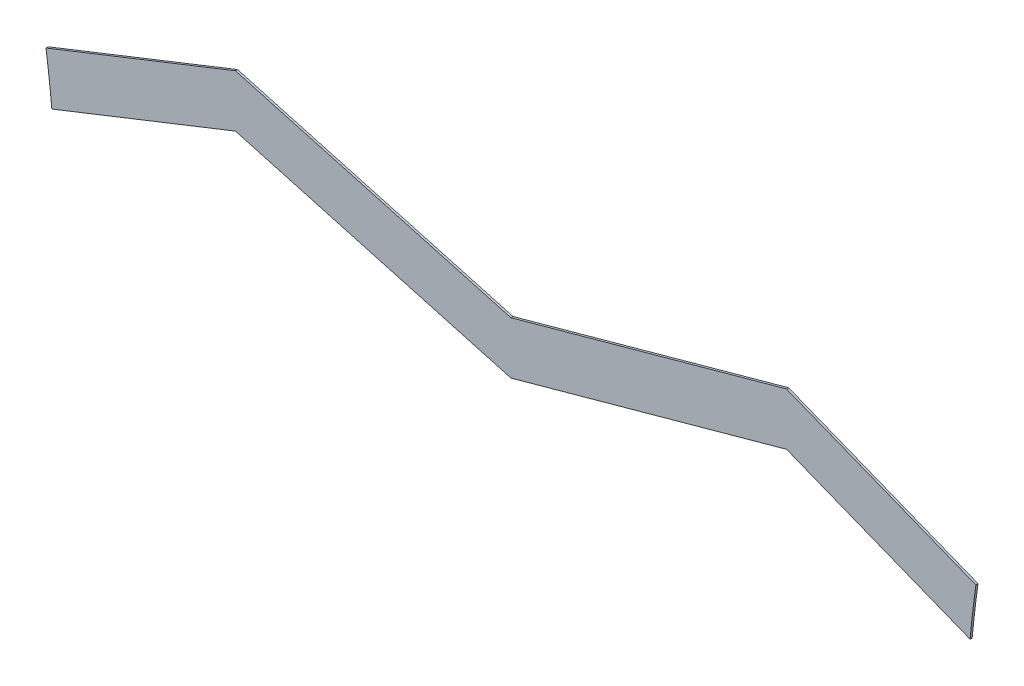
ISO-10303-21;
HEADER;
FILE_DESCRIPTION(('STEP AP214'),'2;1');
FILE_NAME('part.step','',(''),(''),'','','');
FILE_SCHEMA(('AUTOMOTIVE_DESIGN { 1 0 10303 214 1 1 1 1 }'));
ENDSEC;
DATA;
#1=APPLICATION_CONTEXT('core data for automotive mechanical design processes');
#2=APPLICATION_PROTOCOL_DEFINITION('international standard','automotive_design',2000,#1);
#3=PRODUCT_CONTEXT('',#1,'mechanical');
#4=PRODUCT('Part','Part','',(#3));
#5=PRODUCT_RELATED_PRODUCT_CATEGORY('part','',(#4));
#6=PRODUCT_DEFINITION_FORMATION('','',#4);
#7=PRODUCT_DEFINITION_CONTEXT('part definition',#1,'design');
#8=PRODUCT_DEFINITION('design','',#6,#7);
#9=PRODUCT_DEFINITION_SHAPE('','',#8);
#10=(LENGTH_UNIT() NAMED_UNIT(*) SI_UNIT(.MILLI.,.METRE.));
#11=(NAMED_UNIT(*) PLANE_ANGLE_UNIT() SI_UNIT($,.RADIAN.));
#12=(NAMED_UNIT(*) SI_UNIT($,.STERADIAN.) SOLID_ANGLE_UNIT());
#13=UNCERTAINTY_MEASURE_WITH_UNIT(LENGTH_MEASURE(1.E-05),#10,'distance_accuracy_value','');
#14=(GEOMETRIC_REPRESENTATION_CONTEXT(3) GLOBAL_UNCERTAINTY_ASSIGNED_CONTEXT((#13)) GLOBAL_UNIT_ASSIGNED_CONTEXT((#10,
#11,#12)) REPRESENTATION_CONTEXT('',''));
#15=CARTESIAN_POINT('',(0.,0.,0.));
#16=DIRECTION('',(0.,0.,1.));
#17=DIRECTION('',(1.,0.,0.));
#18=AXIS2_PLACEMENT_3D('',#15,#16,#17);
#19=CARTESIAN_POINT('',(113.057369661705,9.45282984114208,0.1));
#20=DIRECTION('',(0.,0.,-1.));
#21=DIRECTION('',(-1.,0.,0.));
#22=AXIS2_PLACEMENT_3D('',#19,#20,#21);
#23=CYLINDRICAL_SURFACE('',#22,53.0159410185819);
#24=CARTESIAN_POINT('',(113.057369661705,9.45282984114208,0.));
#25=DIRECTION('',(0.,0.,-1.));
#26=DIRECTION('',(1.,0.,0.));
#27=AXIS2_PLACEMENT_3D('',#24,#25,#26);
#28=CIRCLE('',#27,53.0159410185819);
#29=CARTESIAN_POINT('',(60.2726956061977,14.3993626611678,0.));
#30=VERTEX_POINT('',#29);
#31=CARTESIAN_POINT('',(60.5514605315682,16.7890078994745,0.));
#32=VERTEX_POINT('',#31);
#33=EDGE_CURVE('E142',#30,#32,#28,.T.);
#34=ORIENTED_EDGE('',*,*,#33,.T.);
#35=DIRECTION('',(0.,0.,-1.));
#36=VECTOR('',#35,1.);
#37=CARTESIAN_POINT('',(60.5514605315682,16.7890078994745,0.1));
#38=LINE('',#37,#36);
#39=CARTESIAN_POINT('',(60.5514605315682,16.7890078994745,0.1));
#40=VERTEX_POINT('',#39);
#41=EDGE_CURVE('E11',#40,#32,#38,.T.);
#42=ORIENTED_EDGE('',*,*,#41,.F.);
#43=CARTESIAN_POINT('',(113.057369661705,9.45282984114208,0.1));
#44=DIRECTION('',(0.,0.,-1.));
#45=DIRECTION('',(1.,0.,0.));
#46=AXIS2_PLACEMENT_3D('',#43,#44,#45);
#47=CIRCLE('',#46,53.0159410185819);
#48=CARTESIAN_POINT('',(60.2726956061977,14.3993626611678,0.1));
#49=VERTEX_POINT('',#48);
#50=EDGE_CURVE('E162',#49,#40,#47,.T.);
#51=ORIENTED_EDGE('',*,*,#50,.F.);
#52=DIRECTION('',(0.,0.,-1.));
#53=VECTOR('',#52,1.);
#54=CARTESIAN_POINT('',(60.2726956061977,14.3993626611678,0.1));
#55=LINE('',#54,#53);
#56=EDGE_CURVE('E138',#49,#30,#55,.T.);
#57=ORIENTED_EDGE('',*,*,#56,.T.);
#58=EDGE_LOOP('',(#34,#42,#51,#57));
#59=FACE_BOUND('',#58,.T.);
#60=ADVANCED_FACE('F33',(#59),#23,.F.);
#61=CARTESIAN_POINT('',(51.4919802703171,20.3753872976957,0.1));
#62=DIRECTION('',(-0.368078186645423,-0.929794842164559,0.));
#63=DIRECTION('',(0.929794842164559,-0.368078186645423,0.));
#64=AXIS2_PLACEMENT_3D('',#61,#62,#63);
#65=PLANE('',#64);
#66=DIRECTION('',(-0.929794842164559,0.368078186645423,0.));
#67=VECTOR('',#66,1.);
#68=CARTESIAN_POINT('',(51.4919802703171,20.3753872976957,0.));
#69=LINE('',#68,#67);
#70=CARTESIAN_POINT('',(51.4919802703171,20.3753872976957,0.));
#71=VERTEX_POINT('',#70);
#72=EDGE_CURVE('E145',#32,#71,#69,.T.);
#73=ORIENTED_EDGE('',*,*,#72,.T.);
#74=DIRECTION('',(0.,0.,-1.));
#75=VECTOR('',#74,1.);
#76=CARTESIAN_POINT('',(51.4919802703171,20.3753872976957,0.1));
#77=LINE('',#76,#75);
#78=CARTESIAN_POINT('',(51.4919802703171,20.3753872976957,0.1));
#79=VERTEX_POINT('',#78);
#80=EDGE_CURVE('E41',#79,#71,#77,.T.);
#81=ORIENTED_EDGE('',*,*,#80,.F.);
#82=DIRECTION('',(-0.929794842164559,0.368078186645423,0.));
#83=VECTOR('',#82,1.);
#84=CARTESIAN_POINT('',(51.4919802703171,20.3753872976957,0.1));
#85=LINE('',#84,#83);
#86=EDGE_CURVE('E96',#40,#79,#85,.T.);
#87=ORIENTED_EDGE('',*,*,#86,.F.);
#88=ORIENTED_EDGE('',*,*,#41,.T.);
#89=EDGE_LOOP('',(#73,#81,#87,#88));
#90=FACE_BOUND('',#89,.T.);
#91=ADVANCED_FACE('F209',(#90),#65,.F.);
#92=CARTESIAN_POINT('',(38.3161420647393,16.7361587573909,0.1));
#93=DIRECTION('',(0.266235900568908,-0.963907902887129,0.));
#94=DIRECTION('',(0.963907902887129,0.266235900568908,0.));
#95=AXIS2_PLACEMENT_3D('',#92,#93,#94);
#96=PLANE('',#95);
#97=DIRECTION('',(-0.963907902887129,-0.266235900568908,0.));
#98=VECTOR('',#97,1.);
#99=CARTESIAN_POINT('',(38.3161420647393,16.7361587573909,0.));
#100=LINE('',#99,#98);
#101=CARTESIAN_POINT('',(38.3161420647393,16.7361587573909,0.));
#102=VERTEX_POINT('',#101);
#103=EDGE_CURVE('E147',#71,#102,#100,.T.);
#104=ORIENTED_EDGE('',*,*,#103,.T.);
#105=DIRECTION('',(0.,0.,-1.));
#106=VECTOR('',#105,1.);
#107=CARTESIAN_POINT('',(38.3161420647393,16.7361587573909,0.1));
#108=LINE('',#107,#106);
#109=CARTESIAN_POINT('',(38.3161420647393,16.7361587573909,0.1));
#110=VERTEX_POINT('',#109);
#111=EDGE_CURVE('E175',#110,#102,#108,.T.);
#112=ORIENTED_EDGE('',*,*,#111,.F.);
#113=DIRECTION('',(-0.963907902887129,-0.266235900568908,0.));
#114=VECTOR('',#113,1.);
#115=CARTESIAN_POINT('',(38.3161420647393,16.7361587573909,0.1));
#116=LINE('',#115,#114);
#117=EDGE_CURVE('E183',#79,#110,#116,.T.);
#118=ORIENTED_EDGE('',*,*,#117,.F.);
#119=ORIENTED_EDGE('',*,*,#80,.T.);
#120=EDGE_LOOP('',(#104,#112,#118,#119));
#121=FACE_BOUND('',#120,.T.);
#122=ADVANCED_FACE('F181',(#121),#96,.F.);
#123=CARTESIAN_POINT('',(25.1404262133166,20.375830252279,0.1));
#124=DIRECTION('',(-0.266268305901821,-0.96389895179535,0.));
#125=DIRECTION('',(0.96389895179535,-0.266268305901821,0.));
#126=AXIS2_PLACEMENT_3D('',#123,#124,#125);
#127=PLANE('',#126);
#128=DIRECTION('',(-0.96389895179535,0.266268305901821,0.));
#129=VECTOR('',#128,1.);
#130=CARTESIAN_POINT('',(25.1404262133166,20.375830252279,0.));
#131=LINE('',#130,#129);
#132=CARTESIAN_POINT('',(25.1404262133166,20.375830252279,0.));
#133=VERTEX_POINT('',#132);
#134=EDGE_CURVE('E149',#102,#133,#131,.T.);
#135=ORIENTED_EDGE('',*,*,#134,.T.);
#136=DIRECTION('',(0.,0.,-1.));
#137=VECTOR('',#136,1.);
#138=CARTESIAN_POINT('',(25.1404262133166,20.375830252279,0.1));
#139=LINE('',#138,#137);
#140=CARTESIAN_POINT('',(25.1404262133166,20.375830252279,0.1));
#141=VERTEX_POINT('',#140);
#142=EDGE_CURVE('E172',#141,#133,#139,.T.);
#143=ORIENTED_EDGE('',*,*,#142,.F.);
#144=DIRECTION('',(-0.96389895179535,0.266268305901821,0.));
#145=VECTOR('',#144,1.);
#146=CARTESIAN_POINT('',(25.1404262133166,20.375830252279,0.1));
#147=LINE('',#146,#145);
#148=EDGE_CURVE('E199',#110,#141,#147,.T.);
#149=ORIENTED_EDGE('',*,*,#148,.F.);
#150=ORIENTED_EDGE('',*,*,#111,.T.);
#151=EDGE_LOOP('',(#135,#143,#149,#150));
#152=FACE_BOUND('',#151,.T.);
#153=ADVANCED_FACE('F190',(#152),#127,.F.);
#154=CARTESIAN_POINT('',(16.0808253872037,16.7897554254692,0.1));
#155=DIRECTION('',(0.36804692779621,-0.929807216007583,0.));
#156=DIRECTION('',(0.929807216007583,0.36804692779621,0.));
#157=AXIS2_PLACEMENT_3D('',#154,#155,#156);
#158=PLANE('',#157);
#159=DIRECTION('',(-0.929807216007583,-0.36804692779621,0.));
#160=VECTOR('',#159,1.);
#161=CARTESIAN_POINT('',(16.0808253872037,16.7897554254692,0.));
#162=LINE('',#161,#160);
#163=CARTESIAN_POINT('',(16.0808253872037,16.7897554254692,0.));
#164=VERTEX_POINT('',#163);
#165=EDGE_CURVE('E151',#133,#164,#162,.T.);
#166=ORIENTED_EDGE('',*,*,#165,.T.);
#167=DIRECTION('',(0.,0.,-1.));
#168=VECTOR('',#167,1.);
#169=CARTESIAN_POINT('',(16.0808253872037,16.7897554254692,0.1));
#170=LINE('',#169,#168);
#171=CARTESIAN_POINT('',(16.0808253872037,16.7897554254692,0.1));
#172=VERTEX_POINT('',#171);
#173=EDGE_CURVE('E169',#172,#164,#170,.T.);
#174=ORIENTED_EDGE('',*,*,#173,.F.);
#175=DIRECTION('',(-0.929807216007583,-0.36804692779621,0.));
#176=VECTOR('',#175,1.);
#177=CARTESIAN_POINT('',(16.0808253872037,16.7897554254692,0.1));
#178=LINE('',#177,#176);
#179=EDGE_CURVE('E196',#141,#172,#178,.T.);
#180=ORIENTED_EDGE('',*,*,#179,.F.);
#181=ORIENTED_EDGE('',*,*,#142,.T.);
#182=EDGE_LOOP('',(#166,#174,#180,#181));
#183=FACE_BOUND('',#182,.T.);
#184=ADVANCED_FACE('F194',(#183),#158,.F.);
#185=CARTESIAN_POINT('',(-36.4253303471932,9.45534256001148,0.1));
#186=DIRECTION('',(0.,0.,-1.));
#187=DIRECTION('',(-1.,0.,0.));
#188=AXIS2_PLACEMENT_3D('',#185,#186,#187);
#189=CYLINDRICAL_SURFACE('',#188,53.0159410185817);
#190=CARTESIAN_POINT('',(-36.4253303471932,9.45534256001148,0.));
#191=DIRECTION('',(0.,0.,-1.));
#192=DIRECTION('',(1.,0.,0.));
#193=AXIS2_PLACEMENT_3D('',#190,#191,#192);
#194=CIRCLE('',#193,53.0159410185817);
#195=CARTESIAN_POINT('',(16.3595099752714,14.4001008167565,0.));
#196=VERTEX_POINT('',#195);
#197=EDGE_CURVE('E153',#164,#196,#194,.T.);
#198=ORIENTED_EDGE('',*,*,#197,.T.);
#199=DIRECTION('',(0.,0.,-1.));
#200=VECTOR('',#199,1.);
#201=CARTESIAN_POINT('',(16.3595099752714,14.4001008167565,0.1));
#202=LINE('',#201,#200);
#203=CARTESIAN_POINT('',(16.3595099752714,14.4001008167565,0.1));
#204=VERTEX_POINT('',#203);
#205=EDGE_CURVE('E166',#204,#196,#202,.T.);
#206=ORIENTED_EDGE('',*,*,#205,.F.);
#207=CARTESIAN_POINT('',(-36.4253303471932,9.45534256001148,0.1));
#208=DIRECTION('',(0.,0.,-1.));
#209=DIRECTION('',(1.,0.,0.));
#210=AXIS2_PLACEMENT_3D('',#207,#208,#209);
#211=CIRCLE('',#210,53.0159410185817);
#212=EDGE_CURVE('E198',#172,#204,#211,.T.);
#213=ORIENTED_EDGE('',*,*,#212,.F.);
#214=ORIENTED_EDGE('',*,*,#173,.T.);
#215=EDGE_LOOP('',(#198,#206,#213,#214));
#216=FACE_BOUND('',#215,.T.);
#217=ADVANCED_FACE('F221',(#216),#189,.F.);
#218=CARTESIAN_POINT('',(16.8070032090925,14.5772327071957,0.1));
#219=DIRECTION('',(-0.36804692779621,0.929807216007583,0.));
#220=DIRECTION('',(-0.929807216007583,-0.36804692779621,0.));
#221=AXIS2_PLACEMENT_3D('',#218,#219,#220);
#222=PLANE('',#221);
#223=DIRECTION('',(0.929807216007583,0.36804692779621,0.));
#224=VECTOR('',#223,1.);
#225=CARTESIAN_POINT('',(16.8070032090925,14.5772327071957,0.));
#226=LINE('',#225,#224);
#227=CARTESIAN_POINT('',(25.1403421661704,17.8758302536918,0.));
#228=VERTEX_POINT('',#227);
#229=EDGE_CURVE('E156',#196,#228,#226,.T.);
#230=ORIENTED_EDGE('',*,*,#229,.T.);
#231=DIRECTION('',(0.,0.,-1.));
#232=VECTOR('',#231,1.);
#233=CARTESIAN_POINT('',(25.1403421661704,17.8758302536918,0.1));
#234=LINE('',#233,#232);
#235=CARTESIAN_POINT('',(25.1403421661704,17.8758302536918,0.1));
#236=VERTEX_POINT('',#235);
#237=EDGE_CURVE('E133',#236,#228,#234,.T.);
#238=ORIENTED_EDGE('',*,*,#237,.F.);
#239=DIRECTION('',(0.929807216009125,0.368046927792312,0.));
#240=VECTOR('',#239,1.);
#241=CARTESIAN_POINT('',(16.3595099752714,14.4001008167565,0.1));
#242=LINE('',#241,#240);
#243=EDGE_CURVE('E122',#204,#236,#242,.T.);
#244=ORIENTED_EDGE('',*,*,#243,.F.);
#245=ORIENTED_EDGE('',*,*,#205,.T.);
#246=EDGE_LOOP('',(#230,#238,#244,#245));
#247=FACE_BOUND('',#246,.T.);
#248=ADVANCED_FACE('F224',(#247),#222,.F.);
#249=CARTESIAN_POINT('',(25.1403421661704,17.8758302536918,0.1));
#250=DIRECTION('',(0.266268305901821,0.96389895179535,0.));
#251=DIRECTION('',(-0.96389895179535,0.266268305901821,0.));
#252=AXIS2_PLACEMENT_3D('',#249,#250,#251);
#253=PLANE('',#252);
#254=DIRECTION('',(0.96389895179535,-0.266268305901821,0.));
#255=VECTOR('',#254,1.);
#256=CARTESIAN_POINT('',(25.1403421661704,17.8758302536918,0.));
#257=LINE('',#256,#255);
#258=CARTESIAN_POINT('',(38.3160580175931,14.2361587588036,0.));
#259=VERTEX_POINT('',#258);
#260=EDGE_CURVE('E131',#228,#259,#257,.T.);
#261=ORIENTED_EDGE('',*,*,#260,.T.);
#262=DIRECTION('',(0.,0.,-1.));
#263=VECTOR('',#262,1.);
#264=CARTESIAN_POINT('',(38.3160580175931,14.2361587588036,0.1));
#265=LINE('',#264,#263);
#266=CARTESIAN_POINT('',(38.3160580175931,14.2361587588036,0.1));
#267=VERTEX_POINT('',#266);
#268=EDGE_CURVE('E128',#267,#259,#265,.T.);
#269=ORIENTED_EDGE('',*,*,#268,.F.);
#270=DIRECTION('',(0.96389895179535,-0.266268305901821,0.));
#271=VECTOR('',#270,1.);
#272=CARTESIAN_POINT('',(25.1403421661704,17.8758302536918,0.1));
#273=LINE('',#272,#271);
#274=EDGE_CURVE('E115',#236,#267,#273,.T.);
#275=ORIENTED_EDGE('',*,*,#274,.F.);
#276=ORIENTED_EDGE('',*,*,#237,.T.);
#277=EDGE_LOOP('',(#261,#269,#275,#276));
#278=FACE_BOUND('',#277,.T.);
#279=ADVANCED_FACE('F129',(#278),#253,.F.);
#280=CARTESIAN_POINT('',(51.4919802703171,17.8753872976957,0.1));
#281=DIRECTION('',(-0.266234322571186,0.963908338736138,0.));
#282=DIRECTION('',(-0.963908338736138,-0.266234322571186,0.));
#283=AXIS2_PLACEMENT_3D('',#280,#281,#282);
#284=PLANE('',#283);
#285=DIRECTION('',(0.963908338736138,0.266234322571186,0.));
#286=VECTOR('',#285,1.);
#287=CARTESIAN_POINT('',(51.4919802703171,17.8753872976957,0.));
#288=LINE('',#287,#286);
#289=CARTESIAN_POINT('',(51.4919802703171,17.8753872976957,0.));
#290=VERTEX_POINT('',#289);
#291=EDGE_CURVE('E159',#259,#290,#288,.T.);
#292=ORIENTED_EDGE('',*,*,#291,.T.);
#293=DIRECTION('',(0.,0.,-1.));
#294=VECTOR('',#293,1.);
#295=CARTESIAN_POINT('',(51.4919802703171,17.8753872976957,0.1));
#296=LINE('',#295,#294);
#297=CARTESIAN_POINT('',(51.4919802703171,17.8753872976957,0.1));
#298=VERTEX_POINT('',#297);
#299=EDGE_CURVE('E134',#298,#290,#296,.T.);
#300=ORIENTED_EDGE('',*,*,#299,.F.);
#301=DIRECTION('',(0.963908338736138,0.266234322571186,0.));
#302=VECTOR('',#301,1.);
#303=CARTESIAN_POINT('',(51.4919802703171,17.8753872976957,0.1));
#304=LINE('',#303,#302);
#305=EDGE_CURVE('E119',#267,#298,#304,.T.);
#306=ORIENTED_EDGE('',*,*,#305,.F.);
#307=ORIENTED_EDGE('',*,*,#268,.T.);
#308=EDGE_LOOP('',(#292,#300,#306,#307));
#309=FACE_BOUND('',#308,.T.);
#310=ADVANCED_FACE('F136',(#309),#284,.F.);
#311=CARTESIAN_POINT('',(59.8215588446621,14.5779543177191,0.1));
#312=DIRECTION('',(0.368078186645431,0.929794842164556,0.));
#313=DIRECTION('',(-0.929794842164556,0.368078186645431,0.));
#314=AXIS2_PLACEMENT_3D('',#311,#312,#313);
#315=PLANE('',#314);
#316=DIRECTION('',(0.929794842164556,-0.368078186645431,0.));
#317=VECTOR('',#316,1.);
#318=CARTESIAN_POINT('',(59.8215588446621,14.5779543177191,0.));
#319=LINE('',#318,#317);
#320=EDGE_CURVE('E84',#290,#30,#319,.T.);
#321=ORIENTED_EDGE('',*,*,#320,.T.);
#322=ORIENTED_EDGE('',*,*,#56,.F.);
#323=DIRECTION('',(0.929794842164559,-0.368078186645424,0.));
#324=VECTOR('',#323,1.);
#325=CARTESIAN_POINT('',(59.8215588446621,14.5779543177191,0.1));
#326=LINE('',#325,#324);
#327=EDGE_CURVE('E49',#298,#49,#326,.T.);
#328=ORIENTED_EDGE('',*,*,#327,.F.);
#329=ORIENTED_EDGE('',*,*,#299,.T.);
#330=EDGE_LOOP('',(#321,#322,#328,#329));
#331=FACE_BOUND('',#330,.T.);
#332=ADVANCED_FACE('F233',(#331),#315,.F.);
#333=CARTESIAN_POINT('',(113.057369661705,9.45282984114208,0.1));
#334=DIRECTION('',(0.,0.,1.));
#335=DIRECTION('',(1.,0.,0.));
#336=AXIS2_PLACEMENT_3D('',#333,#334,#335);
#337=PLANE('',#336);
#338=ORIENTED_EDGE('',*,*,#50,.T.);
#339=ORIENTED_EDGE('',*,*,#86,.T.);
#340=ORIENTED_EDGE('',*,*,#117,.T.);
#341=ORIENTED_EDGE('',*,*,#148,.T.);
#342=ORIENTED_EDGE('',*,*,#179,.T.);
#343=ORIENTED_EDGE('',*,*,#212,.T.);
#344=ORIENTED_EDGE('',*,*,#243,.T.);
#345=ORIENTED_EDGE('',*,*,#274,.T.);
#346=ORIENTED_EDGE('',*,*,#305,.T.);
#347=ORIENTED_EDGE('',*,*,#327,.T.);
#348=EDGE_LOOP('',(#338,#339,#340,#341,#342,#343,#344,#345,#346,#347));
#349=FACE_BOUND('',#348,.T.);
#350=ADVANCED_FACE('F117',(#349),#337,.T.);
#351=CARTESIAN_POINT('',(113.057369661705,9.45282984114208,0.));
#352=DIRECTION('',(0.,0.,1.));
#353=DIRECTION('',(1.,0.,0.));
#354=AXIS2_PLACEMENT_3D('',#351,#352,#353);
#355=PLANE('',#354);
#356=ORIENTED_EDGE('',*,*,#33,.F.);
#357=ORIENTED_EDGE('',*,*,#320,.F.);
#358=ORIENTED_EDGE('',*,*,#291,.F.);
#359=ORIENTED_EDGE('',*,*,#260,.F.);
#360=ORIENTED_EDGE('',*,*,#229,.F.);
#361=ORIENTED_EDGE('',*,*,#197,.F.);
#362=ORIENTED_EDGE('',*,*,#165,.F.);
#363=ORIENTED_EDGE('',*,*,#134,.F.);
#364=ORIENTED_EDGE('',*,*,#103,.F.);
#365=ORIENTED_EDGE('',*,*,#72,.F.);
#366=EDGE_LOOP('',(#356,#357,#358,#359,#360,#361,#362,#363,#364,#365));
#367=FACE_BOUND('',#366,.T.);
#368=ADVANCED_FACE('F185',(#367),#355,.F.);
#369=CLOSED_SHELL('',(#60,#91,#122,#153,#184,#217,#248,#279,#310,#332,#350,#368));
#370=MANIFOLD_SOLID_BREP('B2',#369);
#371=ADVANCED_BREP_SHAPE_REPRESENTATION('',(#18,#370),#14);
#372=SHAPE_DEFINITION_REPRESENTATION(#9,#371);
ENDSEC;
END-ISO-10303-21;
